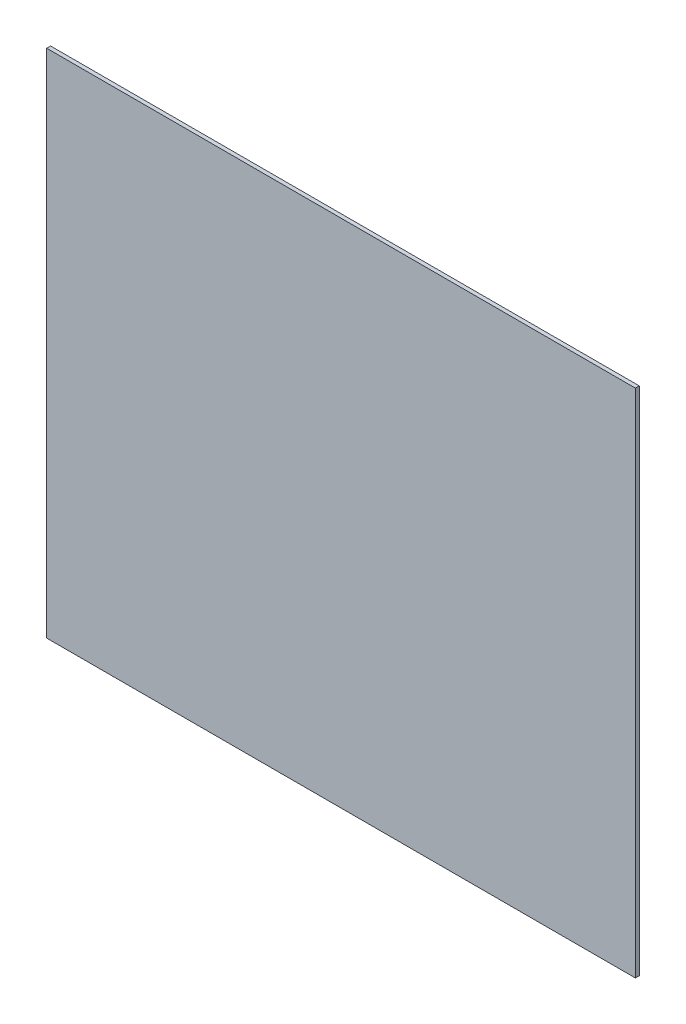
ISO-10303-21;
HEADER;
FILE_DESCRIPTION(('STEP AP214'),'2;1');
FILE_NAME('part.step','',(''),(''),'','','');
FILE_SCHEMA(('AUTOMOTIVE_DESIGN { 1 0 10303 214 1 1 1 1 }'));
ENDSEC;
DATA;
#1=APPLICATION_CONTEXT('core data for automotive mechanical design processes');
#2=APPLICATION_PROTOCOL_DEFINITION('international standard','automotive_design',2000,#1);
#3=PRODUCT_CONTEXT('',#1,'mechanical');
#4=PRODUCT('Part','Part','',(#3));
#5=PRODUCT_RELATED_PRODUCT_CATEGORY('part','',(#4));
#6=PRODUCT_DEFINITION_FORMATION('','',#4);
#7=PRODUCT_DEFINITION_CONTEXT('part definition',#1,'design');
#8=PRODUCT_DEFINITION('design','',#6,#7);
#9=PRODUCT_DEFINITION_SHAPE('','',#8);
#10=(LENGTH_UNIT() NAMED_UNIT(*) SI_UNIT(.MILLI.,.METRE.));
#11=(NAMED_UNIT(*) PLANE_ANGLE_UNIT() SI_UNIT($,.RADIAN.));
#12=(NAMED_UNIT(*) SI_UNIT($,.STERADIAN.) SOLID_ANGLE_UNIT());
#13=UNCERTAINTY_MEASURE_WITH_UNIT(LENGTH_MEASURE(1.E-05),#10,'distance_accuracy_value','');
#14=(GEOMETRIC_REPRESENTATION_CONTEXT(3) GLOBAL_UNCERTAINTY_ASSIGNED_CONTEXT((#13)) GLOBAL_UNIT_ASSIGNED_CONTEXT((#10,
#11,#12)) REPRESENTATION_CONTEXT('',''));
#15=CARTESIAN_POINT('',(0.,0.,0.));
#16=DIRECTION('',(0.,0.,1.));
#17=DIRECTION('',(1.,0.,0.));
#18=AXIS2_PLACEMENT_3D('',#15,#16,#17);
#19=CARTESIAN_POINT('',(227.,197.,0.));
#20=DIRECTION('',(0.,0.,1.));
#21=DIRECTION('',(1.,0.,0.));
#22=AXIS2_PLACEMENT_3D('',#19,#20,#21);
#23=PLANE('',#22);
#24=DIRECTION('',(0.,1.,0.));
#25=VECTOR('',#24,1.);
#26=CARTESIAN_POINT('',(0.,394.,0.));
#27=LINE('',#26,#25);
#28=CARTESIAN_POINT('',(0.,394.,0.));
#29=VERTEX_POINT('',#28);
#30=CARTESIAN_POINT('',(0.,0.,0.));
#31=VERTEX_POINT('',#30);
#32=EDGE_CURVE('E87',#29,#31,#27,.F.);
#33=ORIENTED_EDGE('',*,*,#32,.F.);
#34=DIRECTION('',(1.,0.,0.));
#35=VECTOR('',#34,1.);
#36=CARTESIAN_POINT('',(454.,394.,0.));
#37=LINE('',#36,#35);
#38=CARTESIAN_POINT('',(454.,394.,0.));
#39=VERTEX_POINT('',#38);
#40=EDGE_CURVE('E56',#39,#29,#37,.F.);
#41=ORIENTED_EDGE('',*,*,#40,.F.);
#42=DIRECTION('',(0.,1.,0.));
#43=VECTOR('',#42,1.);
#44=CARTESIAN_POINT('',(454.,0.,0.));
#45=LINE('',#44,#43);
#46=CARTESIAN_POINT('',(454.,0.,0.));
#47=VERTEX_POINT('',#46);
#48=EDGE_CURVE('E58',#47,#39,#45,.T.);
#49=ORIENTED_EDGE('',*,*,#48,.F.);
#50=DIRECTION('',(1.,0.,0.));
#51=VECTOR('',#50,1.);
#52=CARTESIAN_POINT('',(0.,0.,0.));
#53=LINE('',#52,#51);
#54=EDGE_CURVE('E20',#31,#47,#53,.T.);
#55=ORIENTED_EDGE('',*,*,#54,.F.);
#56=EDGE_LOOP('',(#33,#41,#49,#55));
#57=FACE_BOUND('',#56,.T.);
#58=ADVANCED_FACE('F17',(#57),#23,.F.);
#59=CARTESIAN_POINT('',(0.,0.,0.));
#60=DIRECTION('',(0.,-1.,0.));
#61=DIRECTION('',(0.,0.,-1.));
#62=AXIS2_PLACEMENT_3D('',#59,#60,#61);
#63=PLANE('',#62);
#64=DIRECTION('',(1.,0.,0.));
#65=VECTOR('',#64,1.);
#66=CARTESIAN_POINT('',(227.,0.,3.));
#67=LINE('',#66,#65);
#68=CARTESIAN_POINT('',(0.,0.,3.));
#69=VERTEX_POINT('',#68);
#70=CARTESIAN_POINT('',(454.,0.,3.));
#71=VERTEX_POINT('',#70);
#72=EDGE_CURVE('E94',#69,#71,#67,.T.);
#73=ORIENTED_EDGE('',*,*,#72,.F.);
#74=DIRECTION('',(0.,0.,1.));
#75=VECTOR('',#74,1.);
#76=CARTESIAN_POINT('',(0.,0.,0.));
#77=LINE('',#76,#75);
#78=EDGE_CURVE('E70',#31,#69,#77,.T.);
#79=ORIENTED_EDGE('',*,*,#78,.F.);
#80=ORIENTED_EDGE('',*,*,#54,.T.);
#81=DIRECTION('',(0.,0.,-1.));
#82=VECTOR('',#81,1.);
#83=CARTESIAN_POINT('',(454.,0.,0.));
#84=LINE('',#83,#82);
#85=EDGE_CURVE('E65',#71,#47,#84,.T.);
#86=ORIENTED_EDGE('',*,*,#85,.F.);
#87=EDGE_LOOP('',(#73,#79,#80,#86));
#88=FACE_BOUND('',#87,.T.);
#89=ADVANCED_FACE('F67',(#88),#63,.T.);
#90=CARTESIAN_POINT('',(454.,0.,0.));
#91=DIRECTION('',(1.,0.,0.));
#92=DIRECTION('',(0.,0.,-1.));
#93=AXIS2_PLACEMENT_3D('',#90,#91,#92);
#94=PLANE('',#93);
#95=DIRECTION('',(0.,1.,0.));
#96=VECTOR('',#95,1.);
#97=CARTESIAN_POINT('',(454.,197.,3.));
#98=LINE('',#97,#96);
#99=CARTESIAN_POINT('',(454.,394.,3.));
#100=VERTEX_POINT('',#99);
#101=EDGE_CURVE('E75',#71,#100,#98,.T.);
#102=ORIENTED_EDGE('',*,*,#101,.F.);
#103=ORIENTED_EDGE('',*,*,#85,.T.);
#104=ORIENTED_EDGE('',*,*,#48,.T.);
#105=DIRECTION('',(0.,0.,1.));
#106=VECTOR('',#105,1.);
#107=CARTESIAN_POINT('',(454.,394.,0.));
#108=LINE('',#107,#106);
#109=EDGE_CURVE('E82',#100,#39,#108,.F.);
#110=ORIENTED_EDGE('',*,*,#109,.F.);
#111=EDGE_LOOP('',(#102,#103,#104,#110));
#112=FACE_BOUND('',#111,.T.);
#113=ADVANCED_FACE('F73',(#112),#94,.T.);
#114=CARTESIAN_POINT('',(454.,394.,0.));
#115=DIRECTION('',(0.,1.,0.));
#116=DIRECTION('',(0.,0.,1.));
#117=AXIS2_PLACEMENT_3D('',#114,#115,#116);
#118=PLANE('',#117);
#119=DIRECTION('',(1.,0.,0.));
#120=VECTOR('',#119,1.);
#121=CARTESIAN_POINT('',(227.,394.,3.));
#122=LINE('',#121,#120);
#123=CARTESIAN_POINT('',(0.,394.,3.));
#124=VERTEX_POINT('',#123);
#125=EDGE_CURVE('E27',#100,#124,#122,.F.);
#126=ORIENTED_EDGE('',*,*,#125,.F.);
#127=ORIENTED_EDGE('',*,*,#109,.T.);
#128=ORIENTED_EDGE('',*,*,#40,.T.);
#129=DIRECTION('',(0.,0.,1.));
#130=VECTOR('',#129,1.);
#131=CARTESIAN_POINT('',(0.,394.,0.));
#132=LINE('',#131,#130);
#133=EDGE_CURVE('E36',#124,#29,#132,.F.);
#134=ORIENTED_EDGE('',*,*,#133,.F.);
#135=EDGE_LOOP('',(#126,#127,#128,#134));
#136=FACE_BOUND('',#135,.T.);
#137=ADVANCED_FACE('F102',(#136),#118,.T.);
#138=CARTESIAN_POINT('',(0.,394.,0.));
#139=DIRECTION('',(-1.,0.,0.));
#140=DIRECTION('',(0.,0.,1.));
#141=AXIS2_PLACEMENT_3D('',#138,#139,#140);
#142=PLANE('',#141);
#143=DIRECTION('',(0.,1.,0.));
#144=VECTOR('',#143,1.);
#145=CARTESIAN_POINT('',(0.,197.,3.));
#146=LINE('',#145,#144);
#147=EDGE_CURVE('E11',#124,#69,#146,.F.);
#148=ORIENTED_EDGE('',*,*,#147,.F.);
#149=ORIENTED_EDGE('',*,*,#133,.T.);
#150=ORIENTED_EDGE('',*,*,#32,.T.);
#151=ORIENTED_EDGE('',*,*,#78,.T.);
#152=EDGE_LOOP('',(#148,#149,#150,#151));
#153=FACE_BOUND('',#152,.T.);
#154=ADVANCED_FACE('F104',(#153),#142,.T.);
#155=CARTESIAN_POINT('',(227.,197.,3.));
#156=DIRECTION('',(0.,0.,1.));
#157=DIRECTION('',(1.,0.,0.));
#158=AXIS2_PLACEMENT_3D('',#155,#156,#157);
#159=PLANE('',#158);
#160=ORIENTED_EDGE('',*,*,#125,.T.);
#161=ORIENTED_EDGE('',*,*,#147,.T.);
#162=ORIENTED_EDGE('',*,*,#72,.T.);
#163=ORIENTED_EDGE('',*,*,#101,.T.);
#164=EDGE_LOOP('',(#160,#161,#162,#163));
#165=FACE_BOUND('',#164,.T.);
#166=ADVANCED_FACE('F101',(#165),#159,.T.);
#167=CLOSED_SHELL('',(#58,#89,#113,#137,#154,#166));
#168=MANIFOLD_SOLID_BREP('B1',#167);
#169=ADVANCED_BREP_SHAPE_REPRESENTATION('',(#18,#168),#14);
#170=SHAPE_DEFINITION_REPRESENTATION(#9,#169);
ENDSEC;
END-ISO-10303-21;
